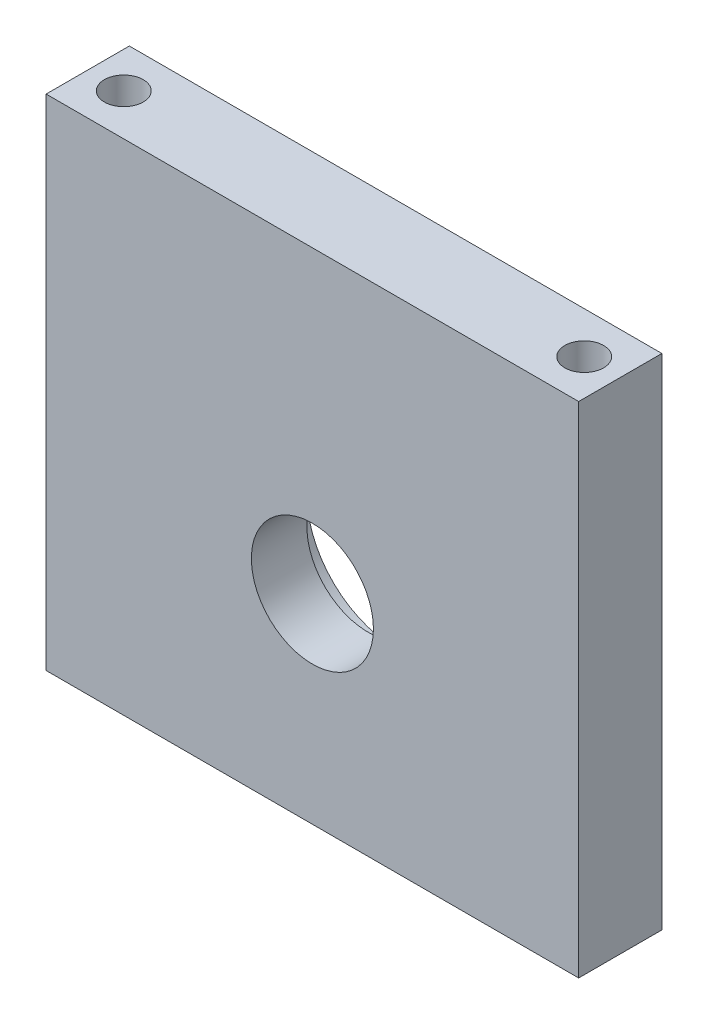
ISO-10303-21;
HEADER;
FILE_DESCRIPTION(('STEP AP214'),'2;1');
FILE_NAME('part.step','',(''),(''),'','','');
FILE_SCHEMA(('AUTOMOTIVE_DESIGN { 1 0 10303 214 1 1 1 1 }'));
ENDSEC;
DATA;
#1=APPLICATION_CONTEXT('core data for automotive mechanical design processes');
#2=APPLICATION_PROTOCOL_DEFINITION('international standard','automotive_design',2000,#1);
#3=PRODUCT_CONTEXT('',#1,'mechanical');
#4=PRODUCT('Part','Part','',(#3));
#5=PRODUCT_RELATED_PRODUCT_CATEGORY('part','',(#4));
#6=PRODUCT_DEFINITION_FORMATION('','',#4);
#7=PRODUCT_DEFINITION_CONTEXT('part definition',#1,'design');
#8=PRODUCT_DEFINITION('design','',#6,#7);
#9=PRODUCT_DEFINITION_SHAPE('','',#8);
#10=(LENGTH_UNIT() NAMED_UNIT(*) SI_UNIT(.MILLI.,.METRE.));
#11=(NAMED_UNIT(*) PLANE_ANGLE_UNIT() SI_UNIT($,.RADIAN.));
#12=(NAMED_UNIT(*) SI_UNIT($,.STERADIAN.) SOLID_ANGLE_UNIT());
#13=UNCERTAINTY_MEASURE_WITH_UNIT(LENGTH_MEASURE(1.E-05),#10,'distance_accuracy_value','');
#14=(GEOMETRIC_REPRESENTATION_CONTEXT(3) GLOBAL_UNCERTAINTY_ASSIGNED_CONTEXT((#13)) GLOBAL_UNIT_ASSIGNED_CONTEXT((#10,
#11,#12)) REPRESENTATION_CONTEXT('',''));
#15=CARTESIAN_POINT('',(0.,0.,0.));
#16=DIRECTION('',(0.,0.,1.));
#17=DIRECTION('',(1.,0.,0.));
#18=AXIS2_PLACEMENT_3D('',#15,#16,#17);
#19=CARTESIAN_POINT('',(24.,22.5,7.5));
#20=DIRECTION('',(-1.,0.,0.));
#21=DIRECTION('',(0.,-1.,0.));
#22=AXIS2_PLACEMENT_3D('',#19,#20,#21);
#23=PLANE('',#22);
#24=DIRECTION('',(0.,1.,0.));
#25=VECTOR('',#24,1.);
#26=CARTESIAN_POINT('',(24.,22.5,0.));
#27=LINE('',#26,#25);
#28=CARTESIAN_POINT('',(24.,-22.5,0.));
#29=VERTEX_POINT('',#28);
#30=CARTESIAN_POINT('',(24.,22.5,0.));
#31=VERTEX_POINT('',#30);
#32=EDGE_CURVE('E96',#29,#31,#27,.T.);
#33=ORIENTED_EDGE('',*,*,#32,.T.);
#34=DIRECTION('',(0.,0.,-1.));
#35=VECTOR('',#34,1.);
#36=CARTESIAN_POINT('',(24.,22.5,7.5));
#37=LINE('',#36,#35);
#38=CARTESIAN_POINT('',(24.,22.5,7.5));
#39=VERTEX_POINT('',#38);
#40=EDGE_CURVE('E11',#39,#31,#37,.T.);
#41=ORIENTED_EDGE('',*,*,#40,.F.);
#42=DIRECTION('',(0.,1.,0.));
#43=VECTOR('',#42,1.);
#44=CARTESIAN_POINT('',(24.,22.5,7.5));
#45=LINE('',#44,#43);
#46=CARTESIAN_POINT('',(24.,-22.5,7.5));
#47=VERTEX_POINT('',#46);
#48=EDGE_CURVE('E84',#47,#39,#45,.T.);
#49=ORIENTED_EDGE('',*,*,#48,.F.);
#50=DIRECTION('',(0.,0.,-1.));
#51=VECTOR('',#50,1.);
#52=CARTESIAN_POINT('',(24.,-22.5,7.5));
#53=LINE('',#52,#51);
#54=EDGE_CURVE('E92',#47,#29,#53,.T.);
#55=ORIENTED_EDGE('',*,*,#54,.T.);
#56=EDGE_LOOP('',(#33,#41,#49,#55));
#57=FACE_BOUND('',#56,.T.);
#58=ADVANCED_FACE('F33',(#57),#23,.F.);
#59=CARTESIAN_POINT('',(-24.,22.5,7.5));
#60=DIRECTION('',(0.,-1.,0.));
#61=DIRECTION('',(0.,0.,-1.));
#62=AXIS2_PLACEMENT_3D('',#59,#60,#61);
#63=PLANE('',#62);
#64=CARTESIAN_POINT('',(-20.75,22.5,3.75000000000001));
#65=DIRECTION('',(0.,1.,0.));
#66=DIRECTION('',(0.,0.,1.));
#67=AXIS2_PLACEMENT_3D('',#64,#65,#66);
#68=CIRCLE('',#67,1.75);
#69=CARTESIAN_POINT('',(-20.75,22.5,5.50000000000001));
#70=VERTEX_POINT('',#69);
#71=EDGE_CURVE('E129',#70,#70,#68,.T.);
#72=ORIENTED_EDGE('',*,*,#71,.F.);
#73=EDGE_LOOP('',(#72));
#74=FACE_BOUND('',#73,.T.);
#75=CARTESIAN_POINT('',(20.75,22.5,3.75000000000001));
#76=DIRECTION('',(0.,1.,0.));
#77=DIRECTION('',(0.,0.,1.));
#78=AXIS2_PLACEMENT_3D('',#75,#76,#77);
#79=CIRCLE('',#78,1.75);
#80=CARTESIAN_POINT('',(20.75,22.5,5.50000000000001));
#81=VERTEX_POINT('',#80);
#82=EDGE_CURVE('E122',#81,#81,#79,.T.);
#83=ORIENTED_EDGE('',*,*,#82,.F.);
#84=EDGE_LOOP('',(#83));
#85=FACE_BOUND('',#84,.T.);
#86=DIRECTION('',(-1.,0.,0.));
#87=VECTOR('',#86,1.);
#88=CARTESIAN_POINT('',(-24.,22.5,0.));
#89=LINE('',#88,#87);
#90=CARTESIAN_POINT('',(-24.,22.5,0.));
#91=VERTEX_POINT('',#90);
#92=EDGE_CURVE('E88',#31,#91,#89,.T.);
#93=ORIENTED_EDGE('',*,*,#92,.T.);
#94=DIRECTION('',(0.,0.,-1.));
#95=VECTOR('',#94,1.);
#96=CARTESIAN_POINT('',(-24.,22.5,7.5));
#97=LINE('',#96,#95);
#98=CARTESIAN_POINT('',(-24.,22.5,7.5));
#99=VERTEX_POINT('',#98);
#100=EDGE_CURVE('E41',#99,#91,#97,.T.);
#101=ORIENTED_EDGE('',*,*,#100,.F.);
#102=DIRECTION('',(-1.,0.,0.));
#103=VECTOR('',#102,1.);
#104=CARTESIAN_POINT('',(-24.,22.5,7.5));
#105=LINE('',#104,#103);
#106=EDGE_CURVE('E79',#39,#99,#105,.T.);
#107=ORIENTED_EDGE('',*,*,#106,.F.);
#108=ORIENTED_EDGE('',*,*,#40,.T.);
#109=EDGE_LOOP('',(#93,#101,#107,#108));
#110=FACE_BOUND('',#109,.T.);
#111=ADVANCED_FACE('F87',(#74,#85,#110),#63,.F.);
#112=CARTESIAN_POINT('',(-24.,22.5,7.5));
#113=DIRECTION('',(1.,0.,0.));
#114=DIRECTION('',(0.,1.,0.));
#115=AXIS2_PLACEMENT_3D('',#112,#113,#114);
#116=PLANE('',#115);
#117=DIRECTION('',(0.,-1.,0.));
#118=VECTOR('',#117,1.);
#119=CARTESIAN_POINT('',(-24.,22.5,0.));
#120=LINE('',#119,#118);
#121=CARTESIAN_POINT('',(-24.,-22.5,0.));
#122=VERTEX_POINT('',#121);
#123=EDGE_CURVE('E66',#91,#122,#120,.T.);
#124=ORIENTED_EDGE('',*,*,#123,.T.);
#125=DIRECTION('',(0.,0.,-1.));
#126=VECTOR('',#125,1.);
#127=CARTESIAN_POINT('',(-24.,-22.5,7.5));
#128=LINE('',#127,#126);
#129=CARTESIAN_POINT('',(-24.,-22.5,7.5));
#130=VERTEX_POINT('',#129);
#131=EDGE_CURVE('E89',#130,#122,#128,.T.);
#132=ORIENTED_EDGE('',*,*,#131,.F.);
#133=DIRECTION('',(0.,-1.,0.));
#134=VECTOR('',#133,1.);
#135=CARTESIAN_POINT('',(-24.,22.5,7.5));
#136=LINE('',#135,#134);
#137=EDGE_CURVE('E82',#99,#130,#136,.T.);
#138=ORIENTED_EDGE('',*,*,#137,.F.);
#139=ORIENTED_EDGE('',*,*,#100,.T.);
#140=EDGE_LOOP('',(#124,#132,#138,#139));
#141=FACE_BOUND('',#140,.T.);
#142=ADVANCED_FACE('F90',(#141),#116,.F.);
#143=CARTESIAN_POINT('',(-24.,-22.5,7.5));
#144=DIRECTION('',(0.,1.,0.));
#145=DIRECTION('',(0.,0.,1.));
#146=AXIS2_PLACEMENT_3D('',#143,#144,#145);
#147=PLANE('',#146);
#148=CARTESIAN_POINT('',(-20.75,-22.5,3.75));
#149=DIRECTION('',(0.,-1.,0.));
#150=DIRECTION('',(0.,0.,-1.));
#151=AXIS2_PLACEMENT_3D('',#148,#149,#150);
#152=CIRCLE('',#151,1.75);
#153=CARTESIAN_POINT('',(-20.75,-22.5,2.));
#154=VERTEX_POINT('',#153);
#155=EDGE_CURVE('E117',#154,#154,#152,.T.);
#156=ORIENTED_EDGE('',*,*,#155,.F.);
#157=EDGE_LOOP('',(#156));
#158=FACE_BOUND('',#157,.T.);
#159=CARTESIAN_POINT('',(20.75,-22.5,3.75));
#160=DIRECTION('',(0.,-1.,0.));
#161=DIRECTION('',(0.,0.,-1.));
#162=AXIS2_PLACEMENT_3D('',#159,#160,#161);
#163=CIRCLE('',#162,1.75);
#164=CARTESIAN_POINT('',(20.75,-22.5,2.));
#165=VERTEX_POINT('',#164);
#166=EDGE_CURVE('E110',#165,#165,#163,.T.);
#167=ORIENTED_EDGE('',*,*,#166,.F.);
#168=EDGE_LOOP('',(#167));
#169=FACE_BOUND('',#168,.T.);
#170=DIRECTION('',(1.,0.,0.));
#171=VECTOR('',#170,1.);
#172=CARTESIAN_POINT('',(-24.,-22.5,0.));
#173=LINE('',#172,#171);
#174=EDGE_CURVE('E72',#122,#29,#173,.T.);
#175=ORIENTED_EDGE('',*,*,#174,.T.);
#176=ORIENTED_EDGE('',*,*,#54,.F.);
#177=DIRECTION('',(1.,0.,0.));
#178=VECTOR('',#177,1.);
#179=CARTESIAN_POINT('',(-24.,-22.5,7.5));
#180=LINE('',#179,#178);
#181=EDGE_CURVE('E49',#130,#47,#180,.T.);
#182=ORIENTED_EDGE('',*,*,#181,.F.);
#183=ORIENTED_EDGE('',*,*,#131,.T.);
#184=EDGE_LOOP('',(#175,#176,#182,#183));
#185=FACE_BOUND('',#184,.T.);
#186=ADVANCED_FACE('F104',(#158,#169,#185),#147,.F.);
#187=CARTESIAN_POINT('',(0.,0.,7.5));
#188=DIRECTION('',(0.,0.,1.));
#189=DIRECTION('',(1.,0.,0.));
#190=AXIS2_PLACEMENT_3D('',#187,#188,#189);
#191=PLANE('',#190);
#192=CARTESIAN_POINT('',(0.,-4.49999999999999,7.5));
#193=DIRECTION('',(0.,0.,1.));
#194=DIRECTION('',(1.,0.,0.));
#195=AXIS2_PLACEMENT_3D('',#192,#193,#194);
#196=CIRCLE('',#195,5.5);
#197=CARTESIAN_POINT('',(5.5,-4.49999999999999,7.5));
#198=VERTEX_POINT('',#197);
#199=EDGE_CURVE('E126',#198,#198,#196,.T.);
#200=ORIENTED_EDGE('',*,*,#199,.F.);
#201=EDGE_LOOP('',(#200));
#202=FACE_BOUND('',#201,.T.);
#203=ORIENTED_EDGE('',*,*,#48,.T.);
#204=ORIENTED_EDGE('',*,*,#106,.T.);
#205=ORIENTED_EDGE('',*,*,#137,.T.);
#206=ORIENTED_EDGE('',*,*,#181,.T.);
#207=EDGE_LOOP('',(#203,#204,#205,#206));
#208=FACE_BOUND('',#207,.T.);
#209=ADVANCED_FACE('F80',(#202,#208),#191,.T.);
#210=CARTESIAN_POINT('',(0.,0.,0.));
#211=DIRECTION('',(0.,0.,1.));
#212=DIRECTION('',(1.,0.,0.));
#213=AXIS2_PLACEMENT_3D('',#210,#211,#212);
#214=PLANE('',#213);
#215=CARTESIAN_POINT('',(0.,-4.49999999999999,0.));
#216=DIRECTION('',(0.,0.,-1.));
#217=DIRECTION('',(-1.,0.,0.));
#218=AXIS2_PLACEMENT_3D('',#215,#216,#217);
#219=CIRCLE('',#218,8.);
#220=CARTESIAN_POINT('',(-8.,-4.49999999999999,0.));
#221=VERTEX_POINT('',#220);
#222=EDGE_CURVE('E140',#221,#221,#219,.T.);
#223=ORIENTED_EDGE('',*,*,#222,.F.);
#224=EDGE_LOOP('',(#223));
#225=FACE_BOUND('',#224,.T.);
#226=ORIENTED_EDGE('',*,*,#32,.F.);
#227=ORIENTED_EDGE('',*,*,#174,.F.);
#228=ORIENTED_EDGE('',*,*,#123,.F.);
#229=ORIENTED_EDGE('',*,*,#92,.F.);
#230=EDGE_LOOP('',(#226,#227,#228,#229));
#231=FACE_BOUND('',#230,.T.);
#232=ADVANCED_FACE('F107',(#225,#231),#214,.F.);
#233=CARTESIAN_POINT('',(20.75,-15.5,3.75));
#234=DIRECTION('',(0.,-1.,0.));
#235=DIRECTION('',(0.,0.,-1.));
#236=AXIS2_PLACEMENT_3D('',#233,#234,#235);
#237=CYLINDRICAL_SURFACE('',#236,1.75);
#238=CARTESIAN_POINT('',(20.75,-15.5,3.75));
#239=DIRECTION('',(0.,-1.,0.));
#240=DIRECTION('',(0.,0.,-1.));
#241=AXIS2_PLACEMENT_3D('',#238,#239,#240);
#242=CIRCLE('',#241,1.75);
#243=CARTESIAN_POINT('',(20.75,-15.5,2.));
#244=VERTEX_POINT('',#243);
#245=EDGE_CURVE('E113',#244,#244,#242,.T.);
#246=ORIENTED_EDGE('',*,*,#245,.F.);
#247=EDGE_LOOP('',(#246));
#248=FACE_BOUND('',#247,.T.);
#249=ORIENTED_EDGE('',*,*,#166,.T.);
#250=EDGE_LOOP('',(#249));
#251=FACE_BOUND('',#250,.T.);
#252=ADVANCED_FACE('F156',(#248,#251),#237,.F.);
#253=CARTESIAN_POINT('',(20.75,-15.5,3.75));
#254=DIRECTION('',(0.,-1.,0.));
#255=DIRECTION('',(0.,0.,-1.));
#256=AXIS2_PLACEMENT_3D('',#253,#254,#255);
#257=PLANE('',#256);
#258=ORIENTED_EDGE('',*,*,#245,.T.);
#259=EDGE_LOOP('',(#258));
#260=FACE_BOUND('',#259,.T.);
#261=ADVANCED_FACE('F162',(#260),#257,.T.);
#262=CARTESIAN_POINT('',(-20.75,-15.5,3.75));
#263=DIRECTION('',(0.,-1.,0.));
#264=DIRECTION('',(0.,0.,-1.));
#265=AXIS2_PLACEMENT_3D('',#262,#263,#264);
#266=CYLINDRICAL_SURFACE('',#265,1.75);
#267=CARTESIAN_POINT('',(-20.75,-15.5,3.75));
#268=DIRECTION('',(0.,-1.,0.));
#269=DIRECTION('',(0.,0.,-1.));
#270=AXIS2_PLACEMENT_3D('',#267,#268,#269);
#271=CIRCLE('',#270,1.75);
#272=CARTESIAN_POINT('',(-20.75,-15.5,2.));
#273=VERTEX_POINT('',#272);
#274=EDGE_CURVE('E99',#273,#273,#271,.T.);
#275=ORIENTED_EDGE('',*,*,#274,.F.);
#276=EDGE_LOOP('',(#275));
#277=FACE_BOUND('',#276,.T.);
#278=ORIENTED_EDGE('',*,*,#155,.T.);
#279=EDGE_LOOP('',(#278));
#280=FACE_BOUND('',#279,.T.);
#281=ADVANCED_FACE('F188',(#277,#280),#266,.F.);
#282=CARTESIAN_POINT('',(-20.75,-15.5,3.75));
#283=DIRECTION('',(0.,-1.,0.));
#284=DIRECTION('',(0.,0.,-1.));
#285=AXIS2_PLACEMENT_3D('',#282,#283,#284);
#286=PLANE('',#285);
#287=ORIENTED_EDGE('',*,*,#274,.T.);
#288=EDGE_LOOP('',(#287));
#289=FACE_BOUND('',#288,.T.);
#290=ADVANCED_FACE('F190',(#289),#286,.T.);
#291=CARTESIAN_POINT('',(20.75,15.5,3.75000000000001));
#292=DIRECTION('',(0.,1.,0.));
#293=DIRECTION('',(0.,0.,1.));
#294=AXIS2_PLACEMENT_3D('',#291,#292,#293);
#295=CYLINDRICAL_SURFACE('',#294,1.75);
#296=CARTESIAN_POINT('',(20.75,15.5,3.75000000000001));
#297=DIRECTION('',(0.,1.,0.));
#298=DIRECTION('',(0.,0.,1.));
#299=AXIS2_PLACEMENT_3D('',#296,#297,#298);
#300=CIRCLE('',#299,1.75);
#301=CARTESIAN_POINT('',(20.75,15.5,5.50000000000001));
#302=VERTEX_POINT('',#301);
#303=EDGE_CURVE('E125',#302,#302,#300,.T.);
#304=ORIENTED_EDGE('',*,*,#303,.F.);
#305=EDGE_LOOP('',(#304));
#306=FACE_BOUND('',#305,.T.);
#307=ORIENTED_EDGE('',*,*,#82,.T.);
#308=EDGE_LOOP('',(#307));
#309=FACE_BOUND('',#308,.T.);
#310=ADVANCED_FACE('F197',(#306,#309),#295,.F.);
#311=CARTESIAN_POINT('',(20.75,15.5,3.75000000000001));
#312=DIRECTION('',(0.,1.,0.));
#313=DIRECTION('',(0.,0.,1.));
#314=AXIS2_PLACEMENT_3D('',#311,#312,#313);
#315=PLANE('',#314);
#316=ORIENTED_EDGE('',*,*,#303,.T.);
#317=EDGE_LOOP('',(#316));
#318=FACE_BOUND('',#317,.T.);
#319=ADVANCED_FACE('F206',(#318),#315,.T.);
#320=CARTESIAN_POINT('',(-20.75,15.5,3.75000000000001));
#321=DIRECTION('',(0.,1.,0.));
#322=DIRECTION('',(0.,0.,1.));
#323=AXIS2_PLACEMENT_3D('',#320,#321,#322);
#324=CYLINDRICAL_SURFACE('',#323,1.75);
#325=CARTESIAN_POINT('',(-20.75,15.5,3.75000000000001));
#326=DIRECTION('',(0.,1.,0.));
#327=DIRECTION('',(0.,0.,1.));
#328=AXIS2_PLACEMENT_3D('',#325,#326,#327);
#329=CIRCLE('',#328,1.75);
#330=CARTESIAN_POINT('',(-20.75,15.5,5.50000000000001));
#331=VERTEX_POINT('',#330);
#332=EDGE_CURVE('E114',#331,#331,#329,.T.);
#333=ORIENTED_EDGE('',*,*,#332,.F.);
#334=EDGE_LOOP('',(#333));
#335=FACE_BOUND('',#334,.T.);
#336=ORIENTED_EDGE('',*,*,#71,.T.);
#337=EDGE_LOOP('',(#336));
#338=FACE_BOUND('',#337,.T.);
#339=ADVANCED_FACE('F210',(#335,#338),#324,.F.);
#340=CARTESIAN_POINT('',(-20.75,15.5,3.75000000000001));
#341=DIRECTION('',(0.,1.,0.));
#342=DIRECTION('',(0.,0.,1.));
#343=AXIS2_PLACEMENT_3D('',#340,#341,#342);
#344=PLANE('',#343);
#345=ORIENTED_EDGE('',*,*,#332,.T.);
#346=EDGE_LOOP('',(#345));
#347=FACE_BOUND('',#346,.T.);
#348=ADVANCED_FACE('F214',(#347),#344,.T.);
#349=CARTESIAN_POINT('',(0.,-4.49999999999999,2.5));
#350=DIRECTION('',(0.,0.,1.));
#351=DIRECTION('',(1.,0.,0.));
#352=AXIS2_PLACEMENT_3D('',#349,#350,#351);
#353=CYLINDRICAL_SURFACE('',#352,5.5);
#354=CARTESIAN_POINT('',(0.,-4.49999999999999,2.5));
#355=DIRECTION('',(0.,0.,1.));
#356=DIRECTION('',(1.,0.,0.));
#357=AXIS2_PLACEMENT_3D('',#354,#355,#356);
#358=CIRCLE('',#357,5.5);
#359=CARTESIAN_POINT('',(5.5,-4.49999999999999,2.5));
#360=VERTEX_POINT('',#359);
#361=EDGE_CURVE('E136',#360,#360,#358,.T.);
#362=ORIENTED_EDGE('',*,*,#361,.F.);
#363=EDGE_LOOP('',(#362));
#364=FACE_BOUND('',#363,.T.);
#365=ORIENTED_EDGE('',*,*,#199,.T.);
#366=EDGE_LOOP('',(#365));
#367=FACE_BOUND('',#366,.T.);
#368=ADVANCED_FACE('F218',(#364,#367),#353,.F.);
#369=CARTESIAN_POINT('',(0.,-4.49999999999999,2.5));
#370=DIRECTION('',(0.,0.,-1.));
#371=DIRECTION('',(-1.,0.,0.));
#372=AXIS2_PLACEMENT_3D('',#369,#370,#371);
#373=PLANE('',#372);
#374=CARTESIAN_POINT('',(0.,-4.49999999999999,2.5));
#375=DIRECTION('',(0.,0.,-1.));
#376=DIRECTION('',(-1.,0.,0.));
#377=AXIS2_PLACEMENT_3D('',#374,#375,#376);
#378=CIRCLE('',#377,8.);
#379=CARTESIAN_POINT('',(-8.,-4.49999999999999,2.5));
#380=VERTEX_POINT('',#379);
#381=EDGE_CURVE('E139',#380,#380,#378,.T.);
#382=ORIENTED_EDGE('',*,*,#381,.T.);
#383=EDGE_LOOP('',(#382));
#384=FACE_BOUND('',#383,.T.);
#385=ORIENTED_EDGE('',*,*,#361,.T.);
#386=EDGE_LOOP('',(#385));
#387=FACE_BOUND('',#386,.T.);
#388=ADVANCED_FACE('F146',(#384,#387),#373,.T.);
#389=CARTESIAN_POINT('',(0.,-4.49999999999999,2.5));
#390=DIRECTION('',(0.,0.,-1.));
#391=DIRECTION('',(-1.,0.,0.));
#392=AXIS2_PLACEMENT_3D('',#389,#390,#391);
#393=CYLINDRICAL_SURFACE('',#392,8.);
#394=ORIENTED_EDGE('',*,*,#381,.F.);
#395=EDGE_LOOP('',(#394));
#396=FACE_BOUND('',#395,.T.);
#397=ORIENTED_EDGE('',*,*,#222,.T.);
#398=EDGE_LOOP('',(#397));
#399=FACE_BOUND('',#398,.T.);
#400=ADVANCED_FACE('F149',(#396,#399),#393,.F.);
#401=CLOSED_SHELL('',(#58,#111,#142,#186,#209,#232,#252,#261,#281,#290,#310,#319,#339,#348,#368,
#388,#400));
#402=MANIFOLD_SOLID_BREP('B2',#401);
#403=ADVANCED_BREP_SHAPE_REPRESENTATION('',(#18,#402),#14);
#404=SHAPE_DEFINITION_REPRESENTATION(#9,#403);
ENDSEC;
END-ISO-10303-21;
